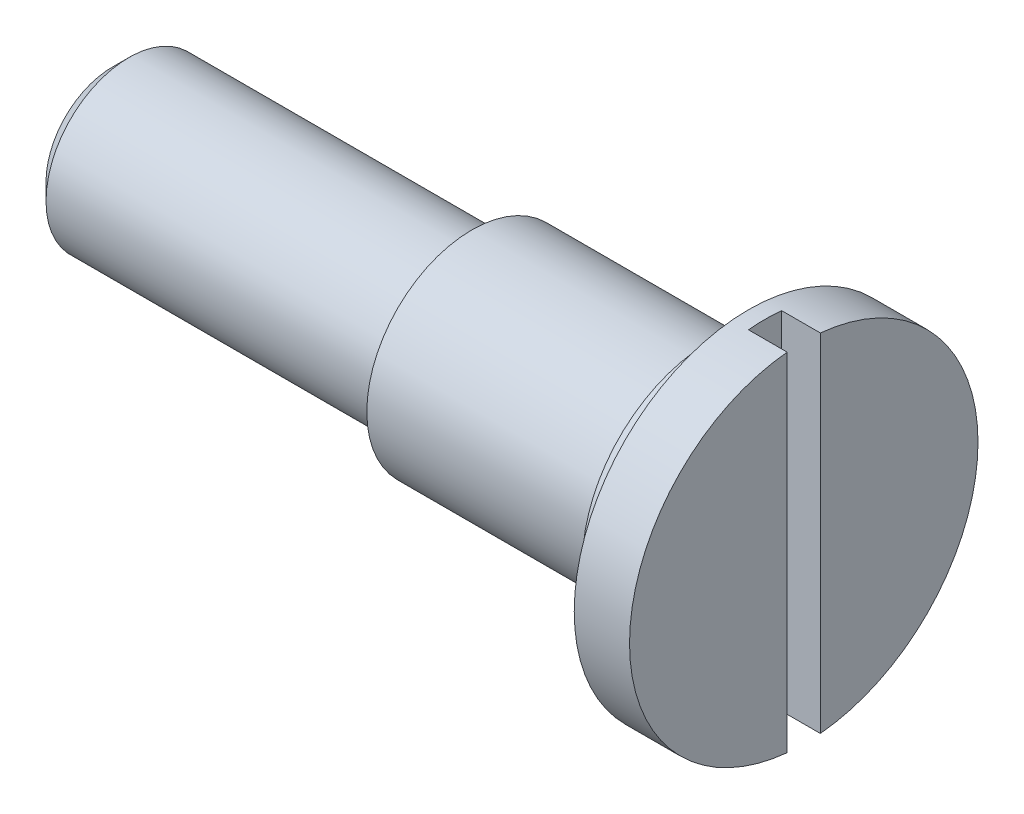
ISO-10303-21;
HEADER;
FILE_DESCRIPTION(('STEP AP214'),'2;1');
FILE_NAME('part.step','',(''),(''),'','','');
FILE_SCHEMA(('AUTOMOTIVE_DESIGN { 1 0 10303 214 1 1 1 1 }'));
ENDSEC;
DATA;
#1=APPLICATION_CONTEXT('core data for automotive mechanical design processes');
#2=APPLICATION_PROTOCOL_DEFINITION('international standard','automotive_design',2000,#1);
#3=PRODUCT_CONTEXT('',#1,'mechanical');
#4=PRODUCT('Part','Part','',(#3));
#5=PRODUCT_RELATED_PRODUCT_CATEGORY('part','',(#4));
#6=PRODUCT_DEFINITION_FORMATION('','',#4);
#7=PRODUCT_DEFINITION_CONTEXT('part definition',#1,'design');
#8=PRODUCT_DEFINITION('design','',#6,#7);
#9=PRODUCT_DEFINITION_SHAPE('','',#8);
#10=(LENGTH_UNIT() NAMED_UNIT(*) SI_UNIT(.MILLI.,.METRE.));
#11=(NAMED_UNIT(*) PLANE_ANGLE_UNIT() SI_UNIT($,.RADIAN.));
#12=(NAMED_UNIT(*) SI_UNIT($,.STERADIAN.) SOLID_ANGLE_UNIT());
#13=UNCERTAINTY_MEASURE_WITH_UNIT(LENGTH_MEASURE(1.E-05),#10,'distance_accuracy_value','');
#14=(GEOMETRIC_REPRESENTATION_CONTEXT(3) GLOBAL_UNCERTAINTY_ASSIGNED_CONTEXT((#13)) GLOBAL_UNIT_ASSIGNED_CONTEXT((#10,
#11,#12)) REPRESENTATION_CONTEXT('',''));
#15=CARTESIAN_POINT('',(0.,0.,0.));
#16=DIRECTION('',(0.,0.,1.));
#17=DIRECTION('',(1.,0.,0.));
#18=AXIS2_PLACEMENT_3D('',#15,#16,#17);
#19=CARTESIAN_POINT('',(-1.84225179240678,0.,0.));
#20=DIRECTION('',(-1.,0.,0.));
#21=DIRECTION('',(0.,0.,1.));
#22=AXIS2_PLACEMENT_3D('',#19,#20,#21);
#23=CYLINDRICAL_SURFACE('',#22,3.15);
#24=CARTESIAN_POINT('',(11.5,0.,0.));
#25=DIRECTION('',(-1.,0.,0.));
#26=DIRECTION('',(0.,0.,1.));
#27=AXIS2_PLACEMENT_3D('',#24,#25,#26);
#28=CIRCLE('',#27,3.15);
#29=CARTESIAN_POINT('',(11.5,0.,3.15));
#30=VERTEX_POINT('',#29);
#31=EDGE_CURVE('E109',#30,#30,#28,.T.);
#32=ORIENTED_EDGE('',*,*,#31,.F.);
#33=EDGE_LOOP('',(#32));
#34=FACE_BOUND('',#33,.T.);
#35=DIRECTION('',(-1.,0.,0.));
#36=VECTOR('',#35,1.);
#37=CARTESIAN_POINT('',(-1.84225179240678,-3.13568174405503,-0.299999999999999));
#38=LINE('',#37,#36);
#39=CARTESIAN_POINT('',(11.8,-3.13568174405503,-0.3));
#40=VERTEX_POINT('',#39);
#41=CARTESIAN_POINT('',(12.5,-3.13568174405503,-0.3));
#42=VERTEX_POINT('',#41);
#43=EDGE_CURVE('E46',#40,#42,#38,.F.);
#44=ORIENTED_EDGE('',*,*,#43,.F.);
#45=CARTESIAN_POINT('',(11.8,0.,0.));
#46=DIRECTION('',(1.,0.,0.));
#47=DIRECTION('',(0.,0.,-1.));
#48=AXIS2_PLACEMENT_3D('',#45,#46,#47);
#49=CIRCLE('',#48,3.15);
#50=CARTESIAN_POINT('',(11.8,-3.13568174405503,0.299999999999999));
#51=VERTEX_POINT('',#50);
#52=EDGE_CURVE('E11',#51,#40,#49,.T.);
#53=ORIENTED_EDGE('',*,*,#52,.F.);
#54=DIRECTION('',(-1.,0.,0.));
#55=VECTOR('',#54,1.);
#56=CARTESIAN_POINT('',(-1.84225179240678,-3.13568174405503,0.299999999999999));
#57=LINE('',#56,#55);
#58=CARTESIAN_POINT('',(12.5,-3.13568174405503,0.3));
#59=VERTEX_POINT('',#58);
#60=EDGE_CURVE('E77',#59,#51,#57,.T.);
#61=ORIENTED_EDGE('',*,*,#60,.F.);
#62=CARTESIAN_POINT('',(12.5,0.,0.));
#63=DIRECTION('',(-1.,0.,0.));
#64=DIRECTION('',(0.,0.,1.));
#65=AXIS2_PLACEMENT_3D('',#62,#63,#64);
#66=CIRCLE('',#65,3.15);
#67=CARTESIAN_POINT('',(12.5,3.13568174405503,0.3));
#68=VERTEX_POINT('',#67);
#69=EDGE_CURVE('E69',#59,#68,#66,.T.);
#70=ORIENTED_EDGE('',*,*,#69,.T.);
#71=DIRECTION('',(-1.,0.,0.));
#72=VECTOR('',#71,1.);
#73=CARTESIAN_POINT('',(-1.84225179240678,3.13568174405503,0.299999999999999));
#74=LINE('',#73,#72);
#75=CARTESIAN_POINT('',(11.8,3.13568174405503,0.299999999999999));
#76=VERTEX_POINT('',#75);
#77=EDGE_CURVE('E81',#76,#68,#74,.F.);
#78=ORIENTED_EDGE('',*,*,#77,.F.);
#79=CARTESIAN_POINT('',(11.8,3.13568174405503,-0.3));
#80=VERTEX_POINT('',#79);
#81=EDGE_CURVE('E35',#80,#76,#49,.T.);
#82=ORIENTED_EDGE('',*,*,#81,.F.);
#83=DIRECTION('',(-1.,0.,0.));
#84=VECTOR('',#83,1.);
#85=CARTESIAN_POINT('',(-1.84225179240678,3.13568174405503,-0.299999999999999));
#86=LINE('',#85,#84);
#87=CARTESIAN_POINT('',(12.5,3.13568174405503,-0.3));
#88=VERTEX_POINT('',#87);
#89=EDGE_CURVE('E75',#88,#80,#86,.T.);
#90=ORIENTED_EDGE('',*,*,#89,.F.);
#91=EDGE_CURVE('E74',#88,#42,#66,.T.);
#92=ORIENTED_EDGE('',*,*,#91,.T.);
#93=EDGE_LOOP('',(#44,#53,#61,#70,#78,#82,#90,#92));
#94=FACE_BOUND('',#93,.T.);
#95=ADVANCED_FACE('F31',(#34,#94),#23,.T.);
#96=CARTESIAN_POINT('',(12.5,0.,-3.15));
#97=DIRECTION('',(-1.,0.,0.));
#98=DIRECTION('',(0.,0.,1.));
#99=AXIS2_PLACEMENT_3D('',#96,#97,#98);
#100=PLANE('',#99);
#101=DIRECTION('',(0.,1.,0.));
#102=VECTOR('',#101,1.);
#103=CARTESIAN_POINT('',(12.5,0.,-0.3));
#104=LINE('',#103,#102);
#105=EDGE_CURVE('E84',#42,#88,#104,.T.);
#106=ORIENTED_EDGE('',*,*,#105,.F.);
#107=ORIENTED_EDGE('',*,*,#91,.F.);
#108=EDGE_LOOP('',(#106,#107));
#109=FACE_BOUND('',#108,.T.);
#110=ADVANCED_FACE('F128',(#109),#100,.F.);
#111=DIRECTION('',(0.,-1.,0.));
#112=VECTOR('',#111,1.);
#113=CARTESIAN_POINT('',(12.5,0.,0.3));
#114=LINE('',#113,#112);
#115=EDGE_CURVE('E72',#68,#59,#114,.T.);
#116=ORIENTED_EDGE('',*,*,#115,.F.);
#117=ORIENTED_EDGE('',*,*,#69,.F.);
#118=EDGE_LOOP('',(#116,#117));
#119=FACE_BOUND('',#118,.T.);
#120=ADVANCED_FACE('F70',(#119),#100,.F.);
#121=CARTESIAN_POINT('',(0.,0.,0.));
#122=DIRECTION('',(1.,0.,0.));
#123=DIRECTION('',(0.,0.,-1.));
#124=AXIS2_PLACEMENT_3D('',#121,#122,#123);
#125=PLANE('',#124);
#126=CARTESIAN_POINT('',(0.,0.,0.));
#127=DIRECTION('',(-1.,0.,0.));
#128=DIRECTION('',(0.,0.,1.));
#129=AXIS2_PLACEMENT_3D('',#126,#127,#128);
#130=CIRCLE('',#129,1.2);
#131=CARTESIAN_POINT('',(0.,0.,1.2));
#132=VERTEX_POINT('',#131);
#133=EDGE_CURVE('E85',#132,#132,#130,.T.);
#134=ORIENTED_EDGE('',*,*,#133,.T.);
#135=EDGE_LOOP('',(#134));
#136=FACE_BOUND('',#135,.T.);
#137=ADVANCED_FACE('F33',(#136),#125,.F.);
#138=CARTESIAN_POINT('',(0.3,0.,0.));
#139=DIRECTION('',(1.,0.,0.));
#140=DIRECTION('',(0.,0.,-1.));
#141=AXIS2_PLACEMENT_3D('',#138,#139,#140);
#142=CONICAL_SURFACE('',#141,1.5,0.785398163397448);
#143=ORIENTED_EDGE('',*,*,#133,.F.);
#144=EDGE_LOOP('',(#143));
#145=FACE_BOUND('',#144,.T.);
#146=CARTESIAN_POINT('',(0.3,0.,0.));
#147=DIRECTION('',(-1.,0.,0.));
#148=DIRECTION('',(0.,0.,1.));
#149=AXIS2_PLACEMENT_3D('',#146,#147,#148);
#150=CIRCLE('',#149,1.5);
#151=CARTESIAN_POINT('',(0.3,0.,1.5));
#152=VERTEX_POINT('',#151);
#153=EDGE_CURVE('E89',#152,#152,#150,.T.);
#154=ORIENTED_EDGE('',*,*,#153,.T.);
#155=EDGE_LOOP('',(#154));
#156=FACE_BOUND('',#155,.T.);
#157=ADVANCED_FACE('F162',(#145,#156),#142,.T.);
#158=CARTESIAN_POINT('',(-1.84225179240678,0.,0.));
#159=DIRECTION('',(-1.,0.,0.));
#160=DIRECTION('',(0.,0.,1.));
#161=AXIS2_PLACEMENT_3D('',#158,#159,#160);
#162=CYLINDRICAL_SURFACE('',#161,1.5);
#163=ORIENTED_EDGE('',*,*,#153,.F.);
#164=EDGE_LOOP('',(#163));
#165=FACE_BOUND('',#164,.T.);
#166=CARTESIAN_POINT('',(6.5,0.,0.));
#167=DIRECTION('',(-1.,0.,0.));
#168=DIRECTION('',(0.,0.,1.));
#169=AXIS2_PLACEMENT_3D('',#166,#167,#168);
#170=CIRCLE('',#169,1.5);
#171=CARTESIAN_POINT('',(6.5,0.,1.5));
#172=VERTEX_POINT('',#171);
#173=EDGE_CURVE('E94',#172,#172,#170,.T.);
#174=ORIENTED_EDGE('',*,*,#173,.T.);
#175=EDGE_LOOP('',(#174));
#176=FACE_BOUND('',#175,.T.);
#177=ADVANCED_FACE('F159',(#165,#176),#162,.T.);
#178=CARTESIAN_POINT('',(6.5,0.,-1.5));
#179=DIRECTION('',(1.,0.,0.));
#180=DIRECTION('',(0.,0.,-1.));
#181=AXIS2_PLACEMENT_3D('',#178,#179,#180);
#182=PLANE('',#181);
#183=ORIENTED_EDGE('',*,*,#173,.F.);
#184=EDGE_LOOP('',(#183));
#185=FACE_BOUND('',#184,.T.);
#186=CARTESIAN_POINT('',(6.5,0.,0.));
#187=DIRECTION('',(-1.,0.,0.));
#188=DIRECTION('',(0.,0.,1.));
#189=AXIS2_PLACEMENT_3D('',#186,#187,#188);
#190=CIRCLE('',#189,1.9);
#191=CARTESIAN_POINT('',(6.5,0.,1.9));
#192=VERTEX_POINT('',#191);
#193=EDGE_CURVE('E97',#192,#192,#190,.T.);
#194=ORIENTED_EDGE('',*,*,#193,.T.);
#195=EDGE_LOOP('',(#194));
#196=FACE_BOUND('',#195,.T.);
#197=ADVANCED_FACE('F155',(#185,#196),#182,.F.);
#198=CARTESIAN_POINT('',(-1.84225179240678,0.,0.));
#199=DIRECTION('',(-1.,0.,0.));
#200=DIRECTION('',(0.,0.,1.));
#201=AXIS2_PLACEMENT_3D('',#198,#199,#200);
#202=CYLINDRICAL_SURFACE('',#201,1.9);
#203=ORIENTED_EDGE('',*,*,#193,.F.);
#204=EDGE_LOOP('',(#203));
#205=FACE_BOUND('',#204,.T.);
#206=CARTESIAN_POINT('',(10.8,0.,0.));
#207=DIRECTION('',(-1.,0.,0.));
#208=DIRECTION('',(0.,0.,1.));
#209=AXIS2_PLACEMENT_3D('',#206,#207,#208);
#210=CIRCLE('',#209,1.9);
#211=CARTESIAN_POINT('',(10.8,0.,1.9));
#212=VERTEX_POINT('',#211);
#213=EDGE_CURVE('E100',#212,#212,#210,.T.);
#214=ORIENTED_EDGE('',*,*,#213,.T.);
#215=EDGE_LOOP('',(#214));
#216=FACE_BOUND('',#215,.T.);
#217=ADVANCED_FACE('F151',(#205,#216),#202,.T.);
#218=CARTESIAN_POINT('',(10.8,0.,-2.3));
#219=DIRECTION('',(1.,0.,0.));
#220=DIRECTION('',(0.,0.,-1.));
#221=AXIS2_PLACEMENT_3D('',#218,#219,#220);
#222=PLANE('',#221);
#223=ORIENTED_EDGE('',*,*,#213,.F.);
#224=EDGE_LOOP('',(#223));
#225=FACE_BOUND('',#224,.T.);
#226=CARTESIAN_POINT('',(10.8,0.,0.));
#227=DIRECTION('',(-1.,0.,0.));
#228=DIRECTION('',(0.,0.,1.));
#229=AXIS2_PLACEMENT_3D('',#226,#227,#228);
#230=CIRCLE('',#229,2.3);
#231=CARTESIAN_POINT('',(10.8,0.,2.3));
#232=VERTEX_POINT('',#231);
#233=EDGE_CURVE('E103',#232,#232,#230,.T.);
#234=ORIENTED_EDGE('',*,*,#233,.T.);
#235=EDGE_LOOP('',(#234));
#236=FACE_BOUND('',#235,.T.);
#237=ADVANCED_FACE('F147',(#225,#236),#222,.F.);
#238=CARTESIAN_POINT('',(-1.84225179240678,0.,0.));
#239=DIRECTION('',(-1.,0.,0.));
#240=DIRECTION('',(0.,0.,1.));
#241=AXIS2_PLACEMENT_3D('',#238,#239,#240);
#242=CYLINDRICAL_SURFACE('',#241,2.3);
#243=ORIENTED_EDGE('',*,*,#233,.F.);
#244=EDGE_LOOP('',(#243));
#245=FACE_BOUND('',#244,.T.);
#246=CARTESIAN_POINT('',(11.5,0.,0.));
#247=DIRECTION('',(-1.,0.,0.));
#248=DIRECTION('',(0.,0.,1.));
#249=AXIS2_PLACEMENT_3D('',#246,#247,#248);
#250=CIRCLE('',#249,2.3);
#251=CARTESIAN_POINT('',(11.5,0.,2.3));
#252=VERTEX_POINT('',#251);
#253=EDGE_CURVE('E106',#252,#252,#250,.T.);
#254=ORIENTED_EDGE('',*,*,#253,.T.);
#255=EDGE_LOOP('',(#254));
#256=FACE_BOUND('',#255,.T.);
#257=ADVANCED_FACE('F143',(#245,#256),#242,.T.);
#258=CARTESIAN_POINT('',(11.5,0.,-3.15));
#259=DIRECTION('',(1.,0.,0.));
#260=DIRECTION('',(0.,0.,-1.));
#261=AXIS2_PLACEMENT_3D('',#258,#259,#260);
#262=PLANE('',#261);
#263=ORIENTED_EDGE('',*,*,#253,.F.);
#264=EDGE_LOOP('',(#263));
#265=FACE_BOUND('',#264,.T.);
#266=ORIENTED_EDGE('',*,*,#31,.T.);
#267=EDGE_LOOP('',(#266));
#268=FACE_BOUND('',#267,.T.);
#269=ADVANCED_FACE('F140',(#265,#268),#262,.F.);
#270=CARTESIAN_POINT('',(11.8,19.1878053721628,-0.3));
#271=DIRECTION('',(1.,0.,0.));
#272=DIRECTION('',(0.,0.,-1.));
#273=AXIS2_PLACEMENT_3D('',#270,#271,#272);
#274=PLANE('',#273);
#275=DIRECTION('',(0.,-1.,0.));
#276=VECTOR('',#275,1.);
#277=CARTESIAN_POINT('',(11.8,19.1878053721628,-0.3));
#278=LINE('',#277,#276);
#279=EDGE_CURVE('E116',#80,#40,#278,.T.);
#280=ORIENTED_EDGE('',*,*,#279,.F.);
#281=ORIENTED_EDGE('',*,*,#81,.T.);
#282=DIRECTION('',(0.,-1.,0.));
#283=VECTOR('',#282,1.);
#284=CARTESIAN_POINT('',(11.8,19.1878053721628,0.3));
#285=LINE('',#284,#283);
#286=EDGE_CURVE('E119',#76,#51,#285,.T.);
#287=ORIENTED_EDGE('',*,*,#286,.T.);
#288=ORIENTED_EDGE('',*,*,#52,.T.);
#289=EDGE_LOOP('',(#280,#281,#287,#288));
#290=FACE_BOUND('',#289,.T.);
#291=ADVANCED_FACE('F123',(#290),#274,.T.);
#292=CARTESIAN_POINT('',(12.5,19.1878053721628,-0.3));
#293=DIRECTION('',(0.,0.,1.));
#294=DIRECTION('',(1.,0.,0.));
#295=AXIS2_PLACEMENT_3D('',#292,#293,#294);
#296=PLANE('',#295);
#297=ORIENTED_EDGE('',*,*,#105,.T.);
#298=ORIENTED_EDGE('',*,*,#89,.T.);
#299=ORIENTED_EDGE('',*,*,#279,.T.);
#300=ORIENTED_EDGE('',*,*,#43,.T.);
#301=EDGE_LOOP('',(#297,#298,#299,#300));
#302=FACE_BOUND('',#301,.T.);
#303=ADVANCED_FACE('F126',(#302),#296,.T.);
#304=CARTESIAN_POINT('',(11.8,19.1878053721628,0.3));
#305=DIRECTION('',(0.,0.,-1.));
#306=DIRECTION('',(-1.,0.,0.));
#307=AXIS2_PLACEMENT_3D('',#304,#305,#306);
#308=PLANE('',#307);
#309=ORIENTED_EDGE('',*,*,#115,.T.);
#310=ORIENTED_EDGE('',*,*,#60,.T.);
#311=ORIENTED_EDGE('',*,*,#286,.F.);
#312=ORIENTED_EDGE('',*,*,#77,.T.);
#313=EDGE_LOOP('',(#309,#310,#311,#312));
#314=FACE_BOUND('',#313,.T.);
#315=ADVANCED_FACE('F83',(#314),#308,.T.);
#316=CLOSED_SHELL('',(#95,#110,#120,#137,#157,#177,#197,#217,#237,#257,#269,#291,#303,#315));
#317=MANIFOLD_SOLID_BREP('B2',#316);
#318=ADVANCED_BREP_SHAPE_REPRESENTATION('',(#18,#317),#14);
#319=SHAPE_DEFINITION_REPRESENTATION(#9,#318);
ENDSEC;
END-ISO-10303-21;
